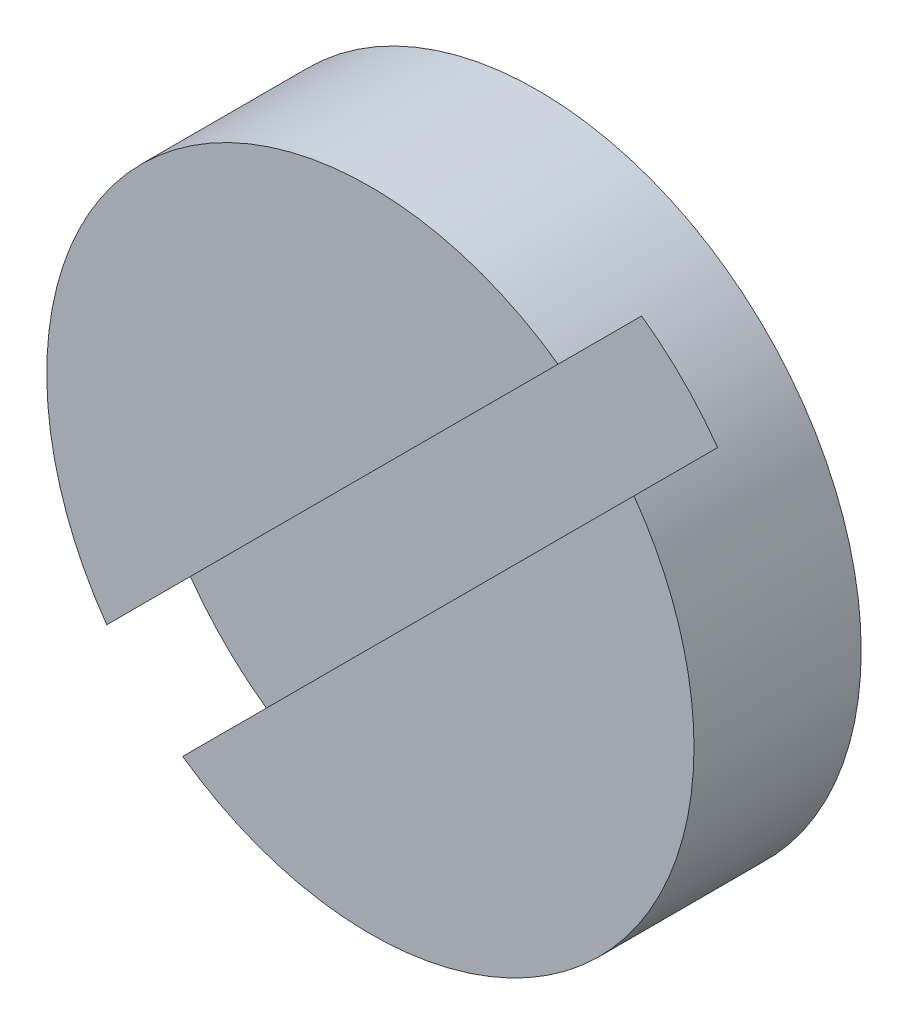
ISO-10303-21;
HEADER;
FILE_DESCRIPTION(('STEP AP214'),'2;1');
FILE_NAME('part.step','',(''),(''),'','','');
FILE_SCHEMA(('AUTOMOTIVE_DESIGN { 1 0 10303 214 1 1 1 1 }'));
ENDSEC;
DATA;
#1=APPLICATION_CONTEXT('core data for automotive mechanical design processes');
#2=APPLICATION_PROTOCOL_DEFINITION('international standard','automotive_design',2000,#1);
#3=PRODUCT_CONTEXT('',#1,'mechanical');
#4=PRODUCT('Part','Part','',(#3));
#5=PRODUCT_RELATED_PRODUCT_CATEGORY('part','',(#4));
#6=PRODUCT_DEFINITION_FORMATION('','',#4);
#7=PRODUCT_DEFINITION_CONTEXT('part definition',#1,'design');
#8=PRODUCT_DEFINITION('design','',#6,#7);
#9=PRODUCT_DEFINITION_SHAPE('','',#8);
#10=(LENGTH_UNIT() NAMED_UNIT(*) SI_UNIT(.MILLI.,.METRE.));
#11=(NAMED_UNIT(*) PLANE_ANGLE_UNIT() SI_UNIT($,.RADIAN.));
#12=(NAMED_UNIT(*) SI_UNIT($,.STERADIAN.) SOLID_ANGLE_UNIT());
#13=UNCERTAINTY_MEASURE_WITH_UNIT(LENGTH_MEASURE(1.E-05),#10,'distance_accuracy_value','');
#14=(GEOMETRIC_REPRESENTATION_CONTEXT(3) GLOBAL_UNCERTAINTY_ASSIGNED_CONTEXT((#13)) GLOBAL_UNIT_ASSIGNED_CONTEXT((#10,
#11,#12)) REPRESENTATION_CONTEXT('',''));
#15=CARTESIAN_POINT('',(0.,0.,0.));
#16=DIRECTION('',(0.,0.,1.));
#17=DIRECTION('',(1.,0.,0.));
#18=AXIS2_PLACEMENT_3D('',#15,#16,#17);
#19=CARTESIAN_POINT('',(8.45887925727502,33.8149793841127,15.6083));
#20=DIRECTION('',(-0.707106781186536,0.707106781186559,0.));
#21=DIRECTION('',(0.,0.,-1.));
#22=AXIS2_PLACEMENT_3D('',#19,#20,#21);
#23=PLANE('',#22);
#24=DIRECTION('',(0.,0.,1.));
#25=VECTOR('',#24,1.);
#26=CARTESIAN_POINT('',(3.17918024418724,28.5352803710251,15.0749));
#27=LINE('',#26,#25);
#28=CARTESIAN_POINT('',(3.17918024418717,28.5352803710251,14.6304));
#29=VERTEX_POINT('',#28);
#30=CARTESIAN_POINT('',(3.17918024418723,28.535280371025,15.5194));
#31=VERTEX_POINT('',#30);
#32=EDGE_CURVE('E79',#29,#31,#27,.T.);
#33=ORIENTED_EDGE('',*,*,#32,.T.);
#34=DIRECTION('',(-0.707106781186546,-0.707106781186549,0.));
#35=VECTOR('',#34,1.);
#36=CARTESIAN_POINT('',(5.57904343195447,30.9351435587922,15.5194));
#37=LINE('',#36,#35);
#38=CARTESIAN_POINT('',(7.9789066197216,33.3350067465593,15.5194));
#39=VERTEX_POINT('',#38);
#40=EDGE_CURVE('E81',#39,#31,#37,.T.);
#41=ORIENTED_EDGE('',*,*,#40,.F.);
#42=DIRECTION('',(0.,0.,-1.));
#43=VECTOR('',#42,1.);
#44=CARTESIAN_POINT('',(7.97890661972157,33.3350067465593,15.0749));
#45=LINE('',#44,#43);
#46=CARTESIAN_POINT('',(7.97890661972157,33.3350067465594,14.6304));
#47=VERTEX_POINT('',#46);
#48=EDGE_CURVE('E82',#39,#47,#45,.T.);
#49=ORIENTED_EDGE('',*,*,#48,.T.);
#50=DIRECTION('',(0.707106781186551,0.707106781186544,0.));
#51=VECTOR('',#50,1.);
#52=CARTESIAN_POINT('',(5.57904343195434,30.9351435587922,14.6304));
#53=LINE('',#52,#51);
#54=EDGE_CURVE('E66',#29,#47,#53,.T.);
#55=ORIENTED_EDGE('',*,*,#54,.F.);
#56=EDGE_LOOP('',(#33,#41,#49,#55));
#57=FACE_BOUND('',#56,.T.);
#58=ADVANCED_FACE('F17',(#57),#23,.T.);
#59=CARTESIAN_POINT('',(5.89766116275868,24.0921716234165,15.5194));
#60=DIRECTION('',(0.,0.,1.));
#61=DIRECTION('',(0.707106781186549,0.707106781186546,0.));
#62=AXIS2_PLACEMENT_3D('',#59,#60,#61);
#63=PLANE('',#62);
#64=ORIENTED_EDGE('',*,*,#40,.T.);
#65=CARTESIAN_POINT('',(5.17493190650629,31.3392550842403,15.5194));
#66=DIRECTION('',(0.,0.,1.));
#67=DIRECTION('',(1.,0.,0.));
#68=AXIS2_PLACEMENT_3D('',#65,#66,#67);
#69=CIRCLE('',#68,3.44170000000006);
#70=EDGE_CURVE('E67',#39,#31,#69,.F.);
#71=ORIENTED_EDGE('',*,*,#70,.F.);
#72=EDGE_LOOP('',(#64,#71));
#73=FACE_BOUND('',#72,.T.);
#74=ADVANCED_FACE('F91',(#73),#63,.T.);
#75=CARTESIAN_POINT('',(5.17493190650629,38.0687943959569,14.6304));
#76=DIRECTION('',(0.,0.,1.));
#77=DIRECTION('',(-0.707106781186547,-0.707106781186548,0.));
#78=AXIS2_PLACEMENT_3D('',#75,#76,#77);
#79=PLANE('',#78);
#80=ORIENTED_EDGE('',*,*,#54,.T.);
#81=CARTESIAN_POINT('',(5.17493190650629,31.3392550842403,14.6304));
#82=DIRECTION('',(0.,0.,1.));
#83=DIRECTION('',(1.,0.,0.));
#84=AXIS2_PLACEMENT_3D('',#81,#82,#83);
#85=CIRCLE('',#84,3.44170000000006);
#86=CARTESIAN_POINT('',(7.17068356882534,34.1432297974556,14.6304));
#87=VERTEX_POINT('',#86);
#88=EDGE_CURVE('E21',#87,#47,#85,.F.);
#89=ORIENTED_EDGE('',*,*,#88,.F.);
#90=DIRECTION('',(0.707106781186543,0.707106781186552,0.));
#91=VECTOR('',#90,1.);
#92=CARTESIAN_POINT('',(4.77082038105818,31.7433666096885,14.6304));
#93=LINE('',#92,#91);
#94=CARTESIAN_POINT('',(2.37095719329099,29.3435034219212,14.6304));
#95=VERTEX_POINT('',#94);
#96=EDGE_CURVE('E63',#95,#87,#93,.T.);
#97=ORIENTED_EDGE('',*,*,#96,.F.);
#98=CARTESIAN_POINT('',(5.17493190650629,31.3392550842403,14.6304));
#99=DIRECTION('',(0.,0.,1.));
#100=DIRECTION('',(1.,0.,0.));
#101=AXIS2_PLACEMENT_3D('',#98,#99,#100);
#102=CIRCLE('',#101,3.44170000000006);
#103=EDGE_CURVE('E56',#29,#95,#102,.F.);
#104=ORIENTED_EDGE('',*,*,#103,.F.);
#105=EDGE_LOOP('',(#80,#89,#97,#104));
#106=FACE_BOUND('',#105,.T.);
#107=ADVANCED_FACE('F62',(#106),#79,.T.);
#108=CARTESIAN_POINT('',(7.65065620637878,34.6232024350091,14.5415));
#109=DIRECTION('',(0.707106781186552,-0.707106781186543,0.));
#110=DIRECTION('',(0.,0.,1.));
#111=AXIS2_PLACEMENT_3D('',#108,#109,#110);
#112=PLANE('',#111);
#113=DIRECTION('',(0.,0.,-1.));
#114=VECTOR('',#113,1.);
#115=CARTESIAN_POINT('',(2.37095719329102,29.3435034219213,15.0749));
#116=LINE('',#115,#114);
#117=CARTESIAN_POINT('',(2.37095719329099,29.3435034219212,15.5194));
#118=VERTEX_POINT('',#117);
#119=EDGE_CURVE('E71',#118,#95,#116,.T.);
#120=ORIENTED_EDGE('',*,*,#119,.T.);
#121=ORIENTED_EDGE('',*,*,#96,.T.);
#122=DIRECTION('',(0.,0.,1.));
#123=VECTOR('',#122,1.);
#124=CARTESIAN_POINT('',(7.17068356882535,34.1432297974557,15.0749));
#125=LINE('',#124,#123);
#126=CARTESIAN_POINT('',(7.17068356882537,34.1432297974556,15.5194));
#127=VERTEX_POINT('',#126);
#128=EDGE_CURVE('E36',#87,#127,#125,.T.);
#129=ORIENTED_EDGE('',*,*,#128,.T.);
#130=DIRECTION('',(0.707106781186548,0.707106781186547,0.));
#131=VECTOR('',#130,1.);
#132=CARTESIAN_POINT('',(4.77082038105826,31.7433666096885,15.5194));
#133=LINE('',#132,#131);
#134=EDGE_CURVE('E74',#118,#127,#133,.T.);
#135=ORIENTED_EDGE('',*,*,#134,.F.);
#136=EDGE_LOOP('',(#120,#121,#129,#135));
#137=FACE_BOUND('',#136,.T.);
#138=ADVANCED_FACE('F73',(#137),#112,.T.);
#139=CARTESIAN_POINT('',(13.3830742572013,31.3392550842403,13.7414));
#140=DIRECTION('',(0.,0.,-1.));
#141=DIRECTION('',(-0.707106781186552,-0.707106781186543,0.));
#142=AXIS2_PLACEMENT_3D('',#139,#140,#141);
#143=PLANE('',#142);
#144=CARTESIAN_POINT('',(5.17493190650629,31.3392550842403,13.7414));
#145=DIRECTION('',(0.,0.,1.));
#146=DIRECTION('',(1.,0.,0.));
#147=AXIS2_PLACEMENT_3D('',#144,#145,#146);
#148=CIRCLE('',#147,3.44170000000006);
#149=CARTESIAN_POINT('',(8.61663190650635,31.3392550842403,13.7414));
#150=VERTEX_POINT('',#149);
#151=EDGE_CURVE('E27',#150,#150,#148,.T.);
#152=ORIENTED_EDGE('',*,*,#151,.F.);
#153=EDGE_LOOP('',(#152));
#154=FACE_BOUND('',#153,.T.);
#155=ADVANCED_FACE('F107',(#154),#143,.T.);
#156=CARTESIAN_POINT('',(4.45220265025393,25.5376301359213,15.5194));
#157=DIRECTION('',(0.,0.,1.));
#158=DIRECTION('',(0.707106781186542,0.707106781186553,0.));
#159=AXIS2_PLACEMENT_3D('',#156,#157,#158);
#160=PLANE('',#159);
#161=ORIENTED_EDGE('',*,*,#134,.T.);
#162=CARTESIAN_POINT('',(5.17493190650629,31.3392550842403,15.5194));
#163=DIRECTION('',(0.,0.,1.));
#164=DIRECTION('',(1.,0.,0.));
#165=AXIS2_PLACEMENT_3D('',#162,#163,#164);
#166=CIRCLE('',#165,3.44170000000006);
#167=EDGE_CURVE('E11',#118,#127,#166,.F.);
#168=ORIENTED_EDGE('',*,*,#167,.F.);
#169=EDGE_LOOP('',(#161,#168));
#170=FACE_BOUND('',#169,.T.);
#171=ADVANCED_FACE('F19',(#170),#160,.T.);
#172=CARTESIAN_POINT('',(5.17493190650629,31.3392550842403,15.5194));
#173=DIRECTION('',(0.,0.,1.));
#174=DIRECTION('',(1.,0.,0.));
#175=AXIS2_PLACEMENT_3D('',#172,#173,#174);
#176=CYLINDRICAL_SURFACE('',#175,3.44170000000006);
#177=ORIENTED_EDGE('',*,*,#128,.F.);
#178=ORIENTED_EDGE('',*,*,#88,.T.);
#179=ORIENTED_EDGE('',*,*,#48,.F.);
#180=ORIENTED_EDGE('',*,*,#70,.T.);
#181=ORIENTED_EDGE('',*,*,#32,.F.);
#182=ORIENTED_EDGE('',*,*,#103,.T.);
#183=ORIENTED_EDGE('',*,*,#119,.F.);
#184=ORIENTED_EDGE('',*,*,#167,.T.);
#185=EDGE_LOOP('',(#177,#178,#179,#180,#181,#182,#183,#184));
#186=FACE_BOUND('',#185,.T.);
#187=ORIENTED_EDGE('',*,*,#151,.T.);
#188=EDGE_LOOP('',(#187));
#189=FACE_BOUND('',#188,.T.);
#190=ADVANCED_FACE('F68',(#186,#189),#176,.T.);
#191=CLOSED_SHELL('',(#58,#74,#107,#138,#155,#171,#190));
#192=MANIFOLD_SOLID_BREP('B1',#191);
#193=ADVANCED_BREP_SHAPE_REPRESENTATION('',(#18,#192),#14);
#194=SHAPE_DEFINITION_REPRESENTATION(#9,#193);
ENDSEC;
END-ISO-10303-21;
